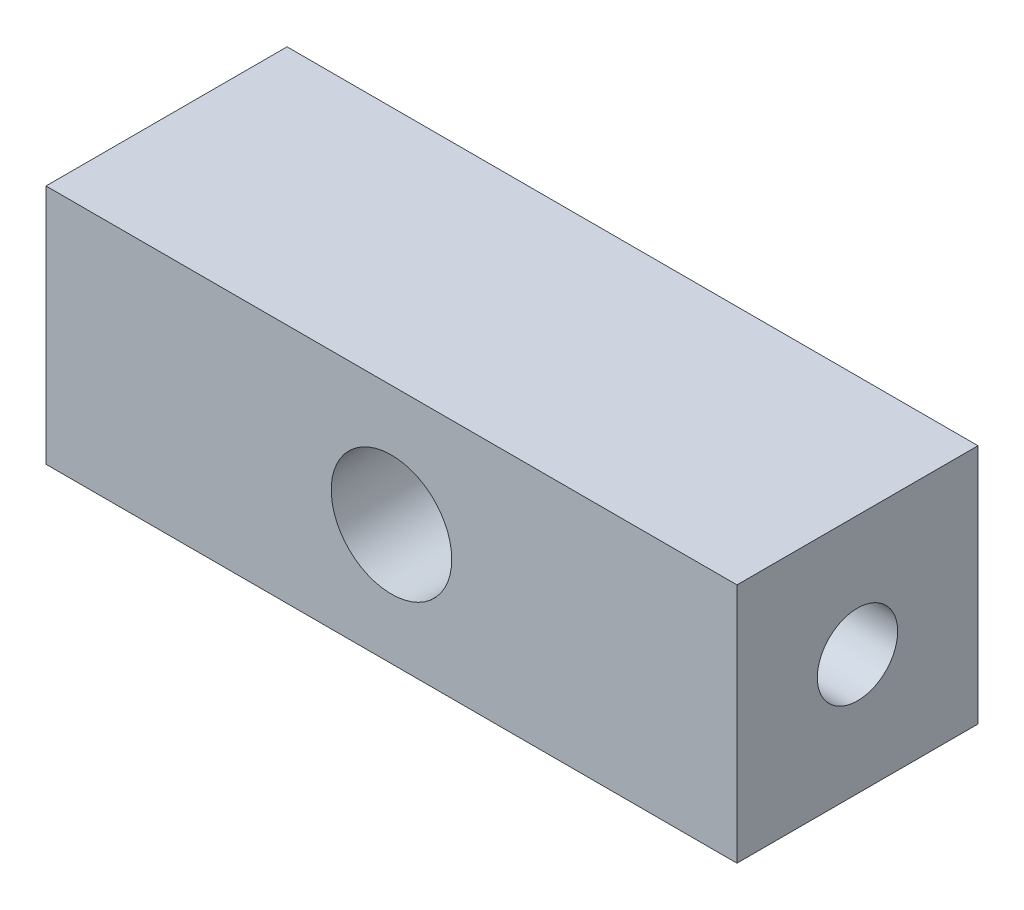
ISO-10303-21;
HEADER;
FILE_DESCRIPTION(('STEP AP214'),'2;1');
FILE_NAME('part.step','',(''),(''),'','','');
FILE_SCHEMA(('AUTOMOTIVE_DESIGN { 1 0 10303 214 1 1 1 1 }'));
ENDSEC;
DATA;
#1=APPLICATION_CONTEXT('core data for automotive mechanical design processes');
#2=APPLICATION_PROTOCOL_DEFINITION('international standard','automotive_design',2000,#1);
#3=PRODUCT_CONTEXT('',#1,'mechanical');
#4=PRODUCT('Part','Part','',(#3));
#5=PRODUCT_RELATED_PRODUCT_CATEGORY('part','',(#4));
#6=PRODUCT_DEFINITION_FORMATION('','',#4);
#7=PRODUCT_DEFINITION_CONTEXT('part definition',#1,'design');
#8=PRODUCT_DEFINITION('design','',#6,#7);
#9=PRODUCT_DEFINITION_SHAPE('','',#8);
#10=(LENGTH_UNIT() NAMED_UNIT(*) SI_UNIT(.MILLI.,.METRE.));
#11=(NAMED_UNIT(*) PLANE_ANGLE_UNIT() SI_UNIT($,.RADIAN.));
#12=(NAMED_UNIT(*) SI_UNIT($,.STERADIAN.) SOLID_ANGLE_UNIT());
#13=UNCERTAINTY_MEASURE_WITH_UNIT(LENGTH_MEASURE(1.E-05),#10,'distance_accuracy_value','');
#14=(GEOMETRIC_REPRESENTATION_CONTEXT(3) GLOBAL_UNCERTAINTY_ASSIGNED_CONTEXT((#13)) GLOBAL_UNIT_ASSIGNED_CONTEXT((#10,
#11,#12)) REPRESENTATION_CONTEXT('',''));
#15=CARTESIAN_POINT('',(0.,0.,0.));
#16=DIRECTION('',(0.,0.,1.));
#17=DIRECTION('',(1.,0.,0.));
#18=AXIS2_PLACEMENT_3D('',#15,#16,#17);
#19=CARTESIAN_POINT('',(0.,0.,15.));
#20=DIRECTION('',(0.,0.,-1.));
#21=DIRECTION('',(-1.,0.,0.));
#22=AXIS2_PLACEMENT_3D('',#19,#20,#21);
#23=PLANE('',#22);
#24=DIRECTION('',(0.,1.,0.));
#25=VECTOR('',#24,1.);
#26=CARTESIAN_POINT('',(43.,-15.,15.));
#27=LINE('',#26,#25);
#28=CARTESIAN_POINT('',(43.,-15.,15.));
#29=VERTEX_POINT('',#28);
#30=CARTESIAN_POINT('',(43.,15.,15.));
#31=VERTEX_POINT('',#30);
#32=EDGE_CURVE('E99',#29,#31,#27,.T.);
#33=ORIENTED_EDGE('',*,*,#32,.T.);
#34=DIRECTION('',(-1.,0.,0.));
#35=VECTOR('',#34,1.);
#36=CARTESIAN_POINT('',(-43.,15.,15.));
#37=LINE('',#36,#35);
#38=CARTESIAN_POINT('',(-43.,15.,15.));
#39=VERTEX_POINT('',#38);
#40=EDGE_CURVE('E94',#31,#39,#37,.T.);
#41=ORIENTED_EDGE('',*,*,#40,.T.);
#42=DIRECTION('',(0.,-1.,0.));
#43=VECTOR('',#42,1.);
#44=CARTESIAN_POINT('',(-43.,-15.,15.));
#45=LINE('',#44,#43);
#46=CARTESIAN_POINT('',(-43.,-15.,15.));
#47=VERTEX_POINT('',#46);
#48=EDGE_CURVE('E97',#39,#47,#45,.T.);
#49=ORIENTED_EDGE('',*,*,#48,.T.);
#50=DIRECTION('',(1.,0.,0.));
#51=VECTOR('',#50,1.);
#52=CARTESIAN_POINT('',(-43.,-15.,15.));
#53=LINE('',#52,#51);
#54=EDGE_CURVE('E64',#47,#29,#53,.T.);
#55=ORIENTED_EDGE('',*,*,#54,.T.);
#56=EDGE_LOOP('',(#33,#41,#49,#55));
#57=FACE_BOUND('',#56,.T.);
#58=CARTESIAN_POINT('',(0.,0.,15.));
#59=DIRECTION('',(0.,0.,1.));
#60=DIRECTION('',(1.,0.,0.));
#61=AXIS2_PLACEMENT_3D('',#58,#59,#60);
#62=CIRCLE('',#61,7.5);
#63=CARTESIAN_POINT('',(7.5,0.,15.));
#64=VERTEX_POINT('',#63);
#65=EDGE_CURVE('E120',#64,#64,#62,.T.);
#66=ORIENTED_EDGE('',*,*,#65,.F.);
#67=EDGE_LOOP('',(#66));
#68=FACE_BOUND('',#67,.T.);
#69=ADVANCED_FACE('F39',(#57,#68),#23,.F.);
#70=CARTESIAN_POINT('',(0.,0.,-15.));
#71=DIRECTION('',(0.,0.,-1.));
#72=DIRECTION('',(-1.,0.,0.));
#73=AXIS2_PLACEMENT_3D('',#70,#71,#72);
#74=PLANE('',#73);
#75=DIRECTION('',(0.,1.,0.));
#76=VECTOR('',#75,1.);
#77=CARTESIAN_POINT('',(43.,-15.,-15.));
#78=LINE('',#77,#76);
#79=CARTESIAN_POINT('',(43.,-15.,-15.));
#80=VERTEX_POINT('',#79);
#81=CARTESIAN_POINT('',(43.,15.,-15.));
#82=VERTEX_POINT('',#81);
#83=EDGE_CURVE('E116',#80,#82,#78,.T.);
#84=ORIENTED_EDGE('',*,*,#83,.F.);
#85=DIRECTION('',(1.,0.,0.));
#86=VECTOR('',#85,1.);
#87=CARTESIAN_POINT('',(-43.,-15.,-15.));
#88=LINE('',#87,#86);
#89=CARTESIAN_POINT('',(-43.,-15.,-15.));
#90=VERTEX_POINT('',#89);
#91=EDGE_CURVE('E87',#90,#80,#88,.T.);
#92=ORIENTED_EDGE('',*,*,#91,.F.);
#93=DIRECTION('',(0.,-1.,0.));
#94=VECTOR('',#93,1.);
#95=CARTESIAN_POINT('',(-43.,-15.,-15.));
#96=LINE('',#95,#94);
#97=CARTESIAN_POINT('',(-43.,15.,-15.));
#98=VERTEX_POINT('',#97);
#99=EDGE_CURVE('E81',#98,#90,#96,.T.);
#100=ORIENTED_EDGE('',*,*,#99,.F.);
#101=DIRECTION('',(-1.,0.,0.));
#102=VECTOR('',#101,1.);
#103=CARTESIAN_POINT('',(-43.,15.,-15.));
#104=LINE('',#103,#102);
#105=EDGE_CURVE('E104',#82,#98,#104,.T.);
#106=ORIENTED_EDGE('',*,*,#105,.F.);
#107=EDGE_LOOP('',(#84,#92,#100,#106));
#108=FACE_BOUND('',#107,.T.);
#109=CARTESIAN_POINT('',(0.,0.,-15.));
#110=DIRECTION('',(0.,0.,1.));
#111=DIRECTION('',(1.,0.,0.));
#112=AXIS2_PLACEMENT_3D('',#109,#110,#111);
#113=CIRCLE('',#112,7.5);
#114=CARTESIAN_POINT('',(7.5,0.,-15.));
#115=VERTEX_POINT('',#114);
#116=EDGE_CURVE('E181',#115,#115,#113,.T.);
#117=ORIENTED_EDGE('',*,*,#116,.T.);
#118=EDGE_LOOP('',(#117));
#119=FACE_BOUND('',#118,.T.);
#120=ADVANCED_FACE('F155',(#108,#119),#74,.T.);
#121=CARTESIAN_POINT('',(43.,-15.,15.));
#122=DIRECTION('',(-1.,0.,0.));
#123=DIRECTION('',(0.,0.,1.));
#124=AXIS2_PLACEMENT_3D('',#121,#122,#123);
#125=PLANE('',#124);
#126=CARTESIAN_POINT('',(43.,0.,0.));
#127=DIRECTION('',(1.,0.,0.));
#128=DIRECTION('',(0.,0.,-1.));
#129=AXIS2_PLACEMENT_3D('',#126,#127,#128);
#130=CIRCLE('',#129,5.);
#131=CARTESIAN_POINT('',(43.,0.,-5.));
#132=VERTEX_POINT('',#131);
#133=EDGE_CURVE('E176',#132,#132,#130,.T.);
#134=ORIENTED_EDGE('',*,*,#133,.F.);
#135=EDGE_LOOP('',(#134));
#136=FACE_BOUND('',#135,.T.);
#137=ORIENTED_EDGE('',*,*,#83,.T.);
#138=DIRECTION('',(0.,0.,-1.));
#139=VECTOR('',#138,1.);
#140=CARTESIAN_POINT('',(43.,15.,15.));
#141=LINE('',#140,#139);
#142=EDGE_CURVE('E11',#31,#82,#141,.T.);
#143=ORIENTED_EDGE('',*,*,#142,.F.);
#144=ORIENTED_EDGE('',*,*,#32,.F.);
#145=DIRECTION('',(0.,0.,-1.));
#146=VECTOR('',#145,1.);
#147=CARTESIAN_POINT('',(43.,-15.,15.));
#148=LINE('',#147,#146);
#149=EDGE_CURVE('E112',#29,#80,#148,.T.);
#150=ORIENTED_EDGE('',*,*,#149,.T.);
#151=EDGE_LOOP('',(#137,#143,#144,#150));
#152=FACE_BOUND('',#151,.T.);
#153=ADVANCED_FACE('F41',(#136,#152),#125,.F.);
#154=CARTESIAN_POINT('',(-43.,15.,15.));
#155=DIRECTION('',(0.,-1.,0.));
#156=DIRECTION('',(0.,0.,-1.));
#157=AXIS2_PLACEMENT_3D('',#154,#155,#156);
#158=PLANE('',#157);
#159=ORIENTED_EDGE('',*,*,#105,.T.);
#160=DIRECTION('',(0.,0.,-1.));
#161=VECTOR('',#160,1.);
#162=CARTESIAN_POINT('',(-43.,15.,15.));
#163=LINE('',#162,#161);
#164=EDGE_CURVE('E55',#39,#98,#163,.T.);
#165=ORIENTED_EDGE('',*,*,#164,.F.);
#166=ORIENTED_EDGE('',*,*,#40,.F.);
#167=ORIENTED_EDGE('',*,*,#142,.T.);
#168=EDGE_LOOP('',(#159,#165,#166,#167));
#169=FACE_BOUND('',#168,.T.);
#170=ADVANCED_FACE('F103',(#169),#158,.F.);
#171=CARTESIAN_POINT('',(-43.,-15.,15.));
#172=DIRECTION('',(1.,0.,0.));
#173=DIRECTION('',(0.,0.,-1.));
#174=AXIS2_PLACEMENT_3D('',#171,#172,#173);
#175=PLANE('',#174);
#176=CARTESIAN_POINT('',(-43.,0.,0.));
#177=DIRECTION('',(1.,0.,0.));
#178=DIRECTION('',(0.,0.,-1.));
#179=AXIS2_PLACEMENT_3D('',#176,#177,#178);
#180=CIRCLE('',#179,5.);
#181=CARTESIAN_POINT('',(-43.,0.,-5.));
#182=VERTEX_POINT('',#181);
#183=EDGE_CURVE('E136',#182,#182,#180,.T.);
#184=ORIENTED_EDGE('',*,*,#183,.T.);
#185=EDGE_LOOP('',(#184));
#186=FACE_BOUND('',#185,.T.);
#187=ORIENTED_EDGE('',*,*,#99,.T.);
#188=DIRECTION('',(0.,0.,-1.));
#189=VECTOR('',#188,1.);
#190=CARTESIAN_POINT('',(-43.,-15.,15.));
#191=LINE('',#190,#189);
#192=EDGE_CURVE('E106',#47,#90,#191,.T.);
#193=ORIENTED_EDGE('',*,*,#192,.F.);
#194=ORIENTED_EDGE('',*,*,#48,.F.);
#195=ORIENTED_EDGE('',*,*,#164,.T.);
#196=EDGE_LOOP('',(#187,#193,#194,#195));
#197=FACE_BOUND('',#196,.T.);
#198=ADVANCED_FACE('F108',(#186,#197),#175,.F.);
#199=CARTESIAN_POINT('',(-43.,-15.,15.));
#200=DIRECTION('',(0.,1.,0.));
#201=DIRECTION('',(0.,0.,1.));
#202=AXIS2_PLACEMENT_3D('',#199,#200,#201);
#203=PLANE('',#202);
#204=ORIENTED_EDGE('',*,*,#91,.T.);
#205=ORIENTED_EDGE('',*,*,#149,.F.);
#206=ORIENTED_EDGE('',*,*,#54,.F.);
#207=ORIENTED_EDGE('',*,*,#192,.T.);
#208=EDGE_LOOP('',(#204,#205,#206,#207));
#209=FACE_BOUND('',#208,.T.);
#210=ADVANCED_FACE('F151',(#209),#203,.F.);
#211=CARTESIAN_POINT('',(0.,0.,15.));
#212=DIRECTION('',(0.,0.,-1.));
#213=DIRECTION('',(-1.,0.,0.));
#214=AXIS2_PLACEMENT_3D('',#211,#212,#213);
#215=CYLINDRICAL_SURFACE('',#214,7.5);
#216=CARTESIAN_POINT('',(-7.5,0.,5.));
#217=CARTESIAN_POINT('',(-7.49999996320963,-0.125608018588548,4.99999996332958));
#218=CARTESIAN_POINT('',(-7.49683780664486,-0.251216670884861,4.99526045609656));
#219=CARTESIAN_POINT('',(-7.48426887523008,-0.501407130429646,4.97637719344278));
#220=CARTESIAN_POINT('',(-7.47486206751269,-0.625988932270019,4.96223338852455));
#221=CARTESIAN_POINT('',(-7.45003382341075,-0.873171719994341,4.92475388496588));
#222=CARTESIAN_POINT('',(-7.43461128487837,-0.99577233861483,4.90141650195336));
#223=CARTESIAN_POINT('',(-7.39811136676745,-1.23813427215697,4.84587344243482));
#224=CARTESIAN_POINT('',(-7.37703158367565,-1.35789435666897,4.8136639964275));
#225=CARTESIAN_POINT('',(-7.32981525375344,-1.59314893798378,4.74098638489601));
#226=CARTESIAN_POINT('',(-7.30370546494928,-1.70866231614512,4.70056186113887));
#227=CARTESIAN_POINT('',(-7.24690654349893,-1.93546860882204,4.61181215495731));
#228=CARTESIAN_POINT('',(-7.21621562725325,-2.04675985824915,4.56348389461676));
#229=CARTESIAN_POINT('',(-7.11817827260879,-2.37341381762447,4.40738741786011));
#230=CARTESIAN_POINT('',(-7.04482484943509,-2.58175996249981,4.28844372586616));
#231=CARTESIAN_POINT('',(-6.88067945428324,-2.99324442404475,4.01334849863612));
#232=CARTESIAN_POINT('',(-6.78893589581815,-3.19444057723902,3.85489609546823));
#233=CARTESIAN_POINT('',(-6.59954434905881,-3.56933031224002,3.51065910883303));
#234=CARTESIAN_POINT('',(-6.5018880214744,-3.74298373794807,3.32483536621252));
#235=CARTESIAN_POINT('',(-6.34919628009922,-3.99366214280298,3.01202024399453));
#236=CARTESIAN_POINT('',(-6.29351311736736,-4.08060552383283,2.89316385177453));
#237=CARTESIAN_POINT('',(-6.18443450280949,-4.24410607449973,2.6475199343164));
#238=CARTESIAN_POINT('',(-6.13103957232405,-4.32066088576891,2.52073061769334));
#239=CARTESIAN_POINT('',(-5.97715554289977,-4.53366662201286,2.12929062591451));
#240=CARTESIAN_POINT('',(-5.88264084043698,-4.65396866792279,1.85293596756271));
#241=CARTESIAN_POINT('',(-5.74940066178898,-4.81686735383668,1.3581492370559));
#242=CARTESIAN_POINT('',(-5.70244638338744,-4.87187088253824,1.1460313437967));
#243=CARTESIAN_POINT('',(-5.64915905133327,-4.93332515657475,0.821257693119102));
#244=CARTESIAN_POINT('',(-5.63425589706967,-4.95029943249,0.711934830996303));
#245=CARTESIAN_POINT('',(-5.61069296640748,-4.97699249744458,0.491757384373762));
#246=CARTESIAN_POINT('',(-5.6020309479698,-4.98671389202271,0.38090336452041));
#247=CARTESIAN_POINT('',(-5.59128886396067,-4.99875512937179,0.157992425508245));
#248=CARTESIAN_POINT('',(-5.58923742257986,-5.00104278396599,0.045932377579079));
#249=CARTESIAN_POINT('',(-5.5918825450767,-4.9980849918467,-0.17800706469552));
#250=CARTESIAN_POINT('',(-5.59657913187616,-4.99283951954458,-0.289886458426012));
#251=CARTESIAN_POINT('',(-5.61252620448123,-4.97490634187683,-0.512636091336137));
#252=CARTESIAN_POINT('',(-5.62378029227563,-4.96221454627213,-0.623505741850759));
#253=CARTESIAN_POINT('',(-5.65238050674852,-4.92961024185719,-0.843396564451179));
#254=CARTESIAN_POINT('',(-5.66972910561612,-4.90969480272766,-0.952416967563864));
#255=CARTESIAN_POINT('',(-5.72818076911837,-4.84163703367357,-1.26603456504467));
#256=CARTESIAN_POINT('',(-5.77653702126334,-4.78429713380928,-1.46736629283408));
#257=CARTESIAN_POINT('',(-5.88774075486078,-4.64674861534595,-1.85759628783405));
#258=CARTESIAN_POINT('',(-5.95059300345544,-4.56653247162609,-2.0464904385054));
#259=CARTESIAN_POINT('',(-6.09910267461486,-4.36685173998334,-2.44754530140424));
#260=CARTESIAN_POINT('',(-6.18679835791932,-4.24272264703471,-2.65662327497203));
#261=CARTESIAN_POINT('',(-6.36729804082079,-3.96670264496565,-3.05348499728716));
#262=CARTESIAN_POINT('',(-6.46010824109834,-3.81477749526626,-3.24124201432436));
#263=CARTESIAN_POINT('',(-6.60779163713999,-3.54969108213473,-3.52437255800004));
#264=CARTESIAN_POINT('',(-6.66328847782504,-3.44464766421749,-3.62713083172277));
#265=CARTESIAN_POINT('',(-6.77217054484313,-3.22531791748826,-3.82347713970009));
#266=CARTESIAN_POINT('',(-6.82555639146258,-3.11103433427816,-3.9170678798286));
#267=CARTESIAN_POINT('',(-6.92883688982357,-2.87366828778324,-4.09438233562589));
#268=CARTESIAN_POINT('',(-6.97873321853711,-2.75059010925358,-4.17811080427028));
#269=CARTESIAN_POINT('',(-7.07374288615761,-2.49611507932345,-4.33494297641303));
#270=CARTESIAN_POINT('',(-7.11885767470596,-2.36472076856899,-4.40804990259985));
#271=CARTESIAN_POINT('',(-7.1947926112122,-2.12083178608808,-4.52955003710702));
#272=CARTESIAN_POINT('',(-7.22668145195663,-2.00967972723592,-4.57997874330749));
#273=CARTESIAN_POINT('',(-7.2859316600916,-1.78295269143194,-4.67290941874381));
#274=CARTESIAN_POINT('',(-7.31329394408637,-1.66737861576613,-4.71541299299981));
#275=CARTESIAN_POINT('',(-7.36291212748662,-1.43245611415626,-4.79200645983731));
#276=CARTESIAN_POINT('',(-7.38517017742725,-1.31310930196114,-4.82609989626979));
#277=CARTESIAN_POINT('',(-7.42408961793734,-1.07138735730615,-4.88544867675417));
#278=CARTESIAN_POINT('',(-7.44075325872844,-0.949013463736592,-4.91070757446615));
#279=CARTESIAN_POINT('',(-7.4681644674329,-0.701493288803491,-4.95214332041752));
#280=CARTESIAN_POINT('',(-7.4788845658993,-0.576336870259732,-4.96827800575267));
#281=CARTESIAN_POINT('',(-7.4940239148013,-0.324780008160031,-4.9910386561188));
#282=CARTESIAN_POINT('',(-7.49844315700379,-0.198379562978779,-4.99766460872505));
#283=CARTESIAN_POINT('',(-7.50086789804063,0.0546163050195368,-5.00130194416532));
#284=CARTESIAN_POINT('',(-7.49887366122603,0.181211719585368,-4.99831372327676));
#285=CARTESIAN_POINT('',(-7.48852351947421,0.433544937832567,-4.98277210202707));
#286=CARTESIAN_POINT('',(-7.48016788605485,0.559282777885928,-4.97021910991058));
#287=CARTESIAN_POINT('',(-7.45811180800349,0.800084092730023,-4.93696015755831));
#288=CARTESIAN_POINT('',(-7.44483013834048,0.915274689503107,-4.91689203663253));
#289=CARTESIAN_POINT('',(-7.41323727394235,1.14332502618366,-4.86892255510859));
#290=CARTESIAN_POINT('',(-7.39492437584217,1.25618396274926,-4.84101854153162));
#291=CARTESIAN_POINT('',(-7.33297199401165,1.59016819827962,-4.74603269888999));
#292=CARTESIAN_POINT('',(-7.28229985688257,1.80689828647146,-4.66764915658682));
#293=CARTESIAN_POINT('',(-7.16240567052806,2.23669773147039,-4.47836285798313));
#294=CARTESIAN_POINT('',(-7.09224590701723,2.44875011842611,-4.36577789105498));
#295=CARTESIAN_POINT('',(-6.94004723718924,2.8516978970661,-4.11391849994205));
#296=CARTESIAN_POINT('',(-6.85800100215921,3.0425801069499,-3.97462759270444));
#297=CARTESIAN_POINT('',(-6.67386338599776,3.42963933761377,-3.64847975744913));
#298=CARTESIAN_POINT('',(-6.57065384591326,3.62188054324072,-3.45758419366078));
#299=CARTESIAN_POINT('',(-6.36427940129081,3.97334834714671,-3.04722158136621));
#300=CARTESIAN_POINT('',(-6.26111457639159,4.13255212685988,-2.82773495453724));
#301=CARTESIAN_POINT('',(-6.07349195966786,4.40311961015302,-2.38214392019828));
#302=CARTESIAN_POINT('',(-5.98818993185449,4.51739093945808,-2.15816986386051));
#303=CARTESIAN_POINT('',(-5.83597435045316,4.71240530724639,-1.69031842127984));
#304=CARTESIAN_POINT('',(-5.76902777392138,4.79320869285461,-1.44647781589623));
#305=CARTESIAN_POINT('',(-5.67333023681701,4.90589604497064,-0.988588649429973));
#306=CARTESIAN_POINT('',(-5.63987506376385,4.94396476310194,-0.777070027915116));
#307=CARTESIAN_POINT('',(-5.59698654785069,4.99248032394649,-0.348567243612225));
#308=CARTESIAN_POINT('',(-5.58752711368552,5.00295716862677,-0.131589276518499));
#309=CARTESIAN_POINT('',(-5.59410544900805,4.99559738764621,0.301609297155851));
#310=CARTESIAN_POINT('',(-5.61015831597501,4.97774399693959,0.517829379343263));
#311=CARTESIAN_POINT('',(-5.66525973970472,4.91492740617482,0.943352637174756));
#312=CARTESIAN_POINT('',(-5.7043389738479,4.8699280383881,1.15264619119367));
#313=CARTESIAN_POINT('',(-5.81317852459072,4.73981418276009,1.61430721309));
#314=CARTESIAN_POINT('',(-5.88833948649796,4.64720557432273,1.86329193737393));
#315=CARTESIAN_POINT('',(-6.0137282216154,4.48217153169634,2.2197721527126));
#316=CARTESIAN_POINT('',(-6.05768608443999,4.4227291606703,2.33588098122704));
#317=CARTESIAN_POINT('',(-6.14853438480218,4.29553797555823,2.5622633756569));
#318=CARTESIAN_POINT('',(-6.19542487694525,4.22778900678103,2.67253683284727));
#319=CARTESIAN_POINT('',(-6.34038233699541,4.0100125161287,2.99813157273274));
#320=CARTESIAN_POINT('',(-6.44119239434723,3.84739387541879,3.20406498890246));
#321=CARTESIAN_POINT('',(-6.5908294854328,3.58070368138863,3.49223623047968));
#322=CARTESIAN_POINT('',(-6.64046727146306,3.48796686520542,3.5848751310009));
#323=CARTESIAN_POINT('',(-6.73828470699057,3.29502624182907,3.76298200605057));
#324=CARTESIAN_POINT('',(-6.78646402214187,3.19482074044039,3.84844834415119));
#325=CARTESIAN_POINT('',(-6.88712610322217,2.97228582382091,4.02347385839299));
#326=CARTESIAN_POINT('',(-6.93922872778525,2.84884898400047,4.11184847540997));
#327=CARTESIAN_POINT('',(-7.03877400576411,2.59315796105784,4.27770219318705));
#328=CARTESIAN_POINT('',(-7.08621876519301,2.46090780863047,4.35518622493486));
#329=CARTESIAN_POINT('',(-7.17506685821063,2.18836443414478,4.49830278427693));
#330=CARTESIAN_POINT('',(-7.21647581452224,2.04807886951547,4.56394635570691));
#331=CARTESIAN_POINT('',(-7.29200187013099,1.76034275764726,4.68245428044414));
#332=CARTESIAN_POINT('',(-7.32612152964091,1.61289474847383,4.73532312146547));
#333=CARTESIAN_POINT('',(-7.37927647812224,1.34555428333911,4.81710032821547));
#334=CARTESIAN_POINT('',(-7.39997893582426,1.22681585673933,4.84872238892977));
#335=CARTESIAN_POINT('',(-7.43582405760531,0.986541218916701,4.90325435730034));
#336=CARTESIAN_POINT('',(-7.45096786434905,0.865005588166455,4.9261660555379));
#337=CARTESIAN_POINT('',(-7.47533722218222,0.620058880061075,4.96294834023699));
#338=CARTESIAN_POINT('',(-7.48456629083545,0.496648962158446,4.97682430043646));
#339=CARTESIAN_POINT('',(-7.49689781286771,0.248826261701855,4.99535032150822));
#340=CARTESIAN_POINT('',(-7.50000003644048,0.124413441706682,5.00000003632167));
#341=CARTESIAN_POINT('',(-7.5,0.,5.));
#342=B_SPLINE_CURVE_WITH_KNOTS('',3,(#216,#217,#218,#219,#220,#221,#222,#223,#224,#225,#226,
#227,#228,#229,#230,#231,#232,#233,#234,#235,#236,#237,#238,#239,#240,#241,#242,#243,#244,#245,
#246,#247,#248,#249,#250,#251,#252,#253,#254,#255,#256,#257,#258,#259,#260,#261,#262,#263,#264,
#265,#266,#267,#268,#269,#270,#271,#272,#273,#274,#275,#276,#277,#278,#279,#280,#281,#282,#283,
#284,#285,#286,#287,#288,#289,#290,#291,#292,#293,#294,#295,#296,#297,#298,#299,#300,#301,#302,
#303,#304,#305,#306,#307,#308,#309,#310,#311,#312,#313,#314,#315,#316,#317,#318,#319,#320,#321,
#322,#323,#324,#325,#326,#327,#328,#329,#330,#331,#332,#333,#334,#335,#336,#337,#338,#339,#340,
#341),.UNSPECIFIED.,.T.,.F.,(4,2,2,2,2,2,2,2,2,2,2,2,2,2,2,2,2,2,2,2,2,2,2,2,2,2,2,2,2,2,2,2,2,
2,2,2,2,2,2,2,2,2,2,2,2,2,2,2,2,2,2,2,2,2,2,2,2,2,2,2,2,2,4),(0.,0.376697150092868,
0.7533962828654,1.13016446348966,1.5070929703719,1.88206910413628,2.2571916123895,
3.00679232609858,3.82000195441008,4.63438651949459,5.10618372652056,5.57808786035318,
6.5193034140896,7.18876311985435,7.52328813363274,7.85769291407032,8.19354375486222,
8.52939573647986,8.86543237335315,9.20160547846822,9.84356710192613,10.4857401421745,
11.2585349135694,12.032288141549,12.5030398312138,12.9736521532471,13.44403673454,
13.9142782967795,14.2923626335413,14.6703703162267,15.0482184414745,15.4259144034603,
15.8053417246619,16.184769541648,16.5641817195628,16.9435777042718,17.2962009039366,
17.6489436346054,18.3538353932503,19.1014251855315,19.8494778884236,20.7158209183258,
21.5827603441875,22.3763648974055,23.1685321808116,23.8182177151969,24.4671965231208,
25.1165595219072,25.7667896111035,26.5902817323984,27.0029102138176,27.4155463806554,
28.2552096763187,28.6754157798874,29.0957174947647,29.5765774176914,30.0572189128906,
30.5374097593981,31.0174316706402,31.3908313299587,31.7641541882901,32.1372548206283,
32.5103694469936),.UNSPECIFIED.);
#343=CARTESIAN_POINT('',(-7.5,0.,5.));
#344=VERTEX_POINT('',#343);
#345=EDGE_CURVE('E43',#344,#344,#342,.T.);
#346=ORIENTED_EDGE('',*,*,#345,.F.);
#347=EDGE_LOOP('',(#346));
#348=FACE_BOUND('',#347,.T.);
#349=CARTESIAN_POINT('',(7.5,0.,-5.));
#350=CARTESIAN_POINT('',(7.49999996320963,-0.125608018588548,-4.99999996332958));
#351=CARTESIAN_POINT('',(7.49683780664486,-0.251216670884861,-4.99526045609656));
#352=CARTESIAN_POINT('',(7.48426887523008,-0.501407130429646,-4.97637719344278));
#353=CARTESIAN_POINT('',(7.47486206751269,-0.625988932270019,-4.96223338852455));
#354=CARTESIAN_POINT('',(7.45003382341075,-0.873171719994341,-4.92475388496588));
#355=CARTESIAN_POINT('',(7.43461128487837,-0.99577233861483,-4.90141650195336));
#356=CARTESIAN_POINT('',(7.39811136676745,-1.23813427215697,-4.84587344243482));
#357=CARTESIAN_POINT('',(7.37703158367565,-1.35789435666897,-4.8136639964275));
#358=CARTESIAN_POINT('',(7.32981525375344,-1.59314893798378,-4.74098638489601));
#359=CARTESIAN_POINT('',(7.30370546494928,-1.70866231614512,-4.70056186113887));
#360=CARTESIAN_POINT('',(7.24690654349893,-1.93546860882204,-4.61181215495731));
#361=CARTESIAN_POINT('',(7.21621562725325,-2.04675985824915,-4.56348389461676));
#362=CARTESIAN_POINT('',(7.11817827260879,-2.37341381762447,-4.40738741786011));
#363=CARTESIAN_POINT('',(7.04482484943509,-2.58175996249981,-4.28844372586616));
#364=CARTESIAN_POINT('',(6.88067945428324,-2.99324442404475,-4.01334849863612));
#365=CARTESIAN_POINT('',(6.78893589581815,-3.19444057723902,-3.85489609546823));
#366=CARTESIAN_POINT('',(6.59954434905881,-3.56933031224002,-3.51065910883303));
#367=CARTESIAN_POINT('',(6.5018880214744,-3.74298373794807,-3.32483536621252));
#368=CARTESIAN_POINT('',(6.34919628009922,-3.99366214280298,-3.01202024399453));
#369=CARTESIAN_POINT('',(6.29351311736736,-4.08060552383283,-2.89316385177453));
#370=CARTESIAN_POINT('',(6.18443450280949,-4.24410607449973,-2.6475199343164));
#371=CARTESIAN_POINT('',(6.13103957232405,-4.32066088576891,-2.52073061769334));
#372=CARTESIAN_POINT('',(5.97715554289977,-4.53366662201286,-2.12929062591451));
#373=CARTESIAN_POINT('',(5.88264084043698,-4.65396866792279,-1.85293596756271));
#374=CARTESIAN_POINT('',(5.74940066178898,-4.81686735383668,-1.3581492370559));
#375=CARTESIAN_POINT('',(5.70244638338744,-4.87187088253824,-1.1460313437967));
#376=CARTESIAN_POINT('',(5.64915905133327,-4.93332515657475,-0.821257693119102));
#377=CARTESIAN_POINT('',(5.63425589706967,-4.95029943249,-0.711934830996303));
#378=CARTESIAN_POINT('',(5.61069296640748,-4.97699249744458,-0.491757384373762));
#379=CARTESIAN_POINT('',(5.6020309479698,-4.98671389202271,-0.38090336452041));
#380=CARTESIAN_POINT('',(5.59128886396067,-4.99875512937179,-0.157992425508245));
#381=CARTESIAN_POINT('',(5.58923742257986,-5.00104278396599,-0.045932377579079));
#382=CARTESIAN_POINT('',(5.5918825450767,-4.9980849918467,0.17800706469552));
#383=CARTESIAN_POINT('',(5.59657913187616,-4.99283951954458,0.289886458426012));
#384=CARTESIAN_POINT('',(5.61252620448123,-4.97490634187683,0.512636091336137));
#385=CARTESIAN_POINT('',(5.62378029227563,-4.96221454627213,0.623505741850759));
#386=CARTESIAN_POINT('',(5.65238050674852,-4.92961024185719,0.843396564451179));
#387=CARTESIAN_POINT('',(5.66972910561612,-4.90969480272766,0.952416967563864));
#388=CARTESIAN_POINT('',(5.72818076911837,-4.84163703367357,1.26603456504467));
#389=CARTESIAN_POINT('',(5.77653702126334,-4.78429713380928,1.46736629283408));
#390=CARTESIAN_POINT('',(5.88774075486078,-4.64674861534595,1.85759628783405));
#391=CARTESIAN_POINT('',(5.95059300345544,-4.56653247162609,2.0464904385054));
#392=CARTESIAN_POINT('',(6.09910267461486,-4.36685173998334,2.44754530140424));
#393=CARTESIAN_POINT('',(6.18679835791932,-4.24272264703471,2.65662327497203));
#394=CARTESIAN_POINT('',(6.36729804082079,-3.96670264496565,3.05348499728716));
#395=CARTESIAN_POINT('',(6.46010824109834,-3.81477749526626,3.24124201432436));
#396=CARTESIAN_POINT('',(6.60779163713999,-3.54969108213473,3.52437255800004));
#397=CARTESIAN_POINT('',(6.66328847782504,-3.44464766421749,3.62713083172277));
#398=CARTESIAN_POINT('',(6.77217054484313,-3.22531791748826,3.82347713970009));
#399=CARTESIAN_POINT('',(6.82555639146258,-3.11103433427816,3.9170678798286));
#400=CARTESIAN_POINT('',(6.92883688982357,-2.87366828778324,4.09438233562589));
#401=CARTESIAN_POINT('',(6.97873321853711,-2.75059010925358,4.17811080427028));
#402=CARTESIAN_POINT('',(7.07374288615761,-2.49611507932345,4.33494297641303));
#403=CARTESIAN_POINT('',(7.11885767470596,-2.36472076856899,4.40804990259985));
#404=CARTESIAN_POINT('',(7.1947926112122,-2.12083178608808,4.52955003710702));
#405=CARTESIAN_POINT('',(7.22668145195663,-2.00967972723592,4.57997874330749));
#406=CARTESIAN_POINT('',(7.2859316600916,-1.78295269143194,4.67290941874381));
#407=CARTESIAN_POINT('',(7.31329394408637,-1.66737861576613,4.71541299299981));
#408=CARTESIAN_POINT('',(7.36291212748662,-1.43245611415626,4.79200645983731));
#409=CARTESIAN_POINT('',(7.38517017742725,-1.31310930196114,4.82609989626979));
#410=CARTESIAN_POINT('',(7.42408961793734,-1.07138735730615,4.88544867675417));
#411=CARTESIAN_POINT('',(7.44075325872844,-0.949013463736592,4.91070757446615));
#412=CARTESIAN_POINT('',(7.4681644674329,-0.701493288803491,4.95214332041752));
#413=CARTESIAN_POINT('',(7.4788845658993,-0.576336870259732,4.96827800575267));
#414=CARTESIAN_POINT('',(7.4940239148013,-0.324780008160031,4.9910386561188));
#415=CARTESIAN_POINT('',(7.49844315700379,-0.198379562978779,4.99766460872505));
#416=CARTESIAN_POINT('',(7.50086789804063,0.0546163050195368,5.00130194416532));
#417=CARTESIAN_POINT('',(7.49887366122603,0.181211719585368,4.99831372327676));
#418=CARTESIAN_POINT('',(7.48852351947421,0.433544937832567,4.98277210202707));
#419=CARTESIAN_POINT('',(7.48016788605485,0.559282777885928,4.97021910991058));
#420=CARTESIAN_POINT('',(7.45811180800349,0.800084092730023,4.93696015755831));
#421=CARTESIAN_POINT('',(7.44483013834048,0.915274689503107,4.91689203663253));
#422=CARTESIAN_POINT('',(7.41323727394235,1.14332502618366,4.86892255510859));
#423=CARTESIAN_POINT('',(7.39492437584217,1.25618396274926,4.84101854153162));
#424=CARTESIAN_POINT('',(7.33297199401165,1.59016819827962,4.74603269888999));
#425=CARTESIAN_POINT('',(7.28229985688257,1.80689828647146,4.66764915658682));
#426=CARTESIAN_POINT('',(7.16240567052806,2.23669773147039,4.47836285798313));
#427=CARTESIAN_POINT('',(7.09224590701723,2.44875011842611,4.36577789105498));
#428=CARTESIAN_POINT('',(6.94004723718924,2.8516978970661,4.11391849994205));
#429=CARTESIAN_POINT('',(6.85800100215921,3.0425801069499,3.97462759270444));
#430=CARTESIAN_POINT('',(6.67386338599776,3.42963933761377,3.64847975744913));
#431=CARTESIAN_POINT('',(6.57065384591326,3.62188054324072,3.45758419366078));
#432=CARTESIAN_POINT('',(6.36427940129081,3.97334834714671,3.04722158136621));
#433=CARTESIAN_POINT('',(6.26111457639159,4.13255212685988,2.82773495453724));
#434=CARTESIAN_POINT('',(6.07349195966786,4.40311961015302,2.38214392019828));
#435=CARTESIAN_POINT('',(5.98818993185449,4.51739093945808,2.15816986386051));
#436=CARTESIAN_POINT('',(5.83597435045316,4.71240530724639,1.69031842127984));
#437=CARTESIAN_POINT('',(5.76902777392138,4.79320869285461,1.44647781589623));
#438=CARTESIAN_POINT('',(5.67333023681701,4.90589604497064,0.988588649429973));
#439=CARTESIAN_POINT('',(5.63987506376385,4.94396476310194,0.777070027915116));
#440=CARTESIAN_POINT('',(5.59698654785069,4.99248032394649,0.348567243612225));
#441=CARTESIAN_POINT('',(5.58752711368552,5.00295716862677,0.131589276518499));
#442=CARTESIAN_POINT('',(5.59410544900805,4.99559738764621,-0.301609297155851));
#443=CARTESIAN_POINT('',(5.61015831597501,4.97774399693959,-0.517829379343263));
#444=CARTESIAN_POINT('',(5.66525973970472,4.91492740617482,-0.943352637174756));
#445=CARTESIAN_POINT('',(5.7043389738479,4.8699280383881,-1.15264619119367));
#446=CARTESIAN_POINT('',(5.81317852459072,4.73981418276009,-1.61430721309));
#447=CARTESIAN_POINT('',(5.88833948649796,4.64720557432273,-1.86329193737393));
#448=CARTESIAN_POINT('',(6.0137282216154,4.48217153169634,-2.2197721527126));
#449=CARTESIAN_POINT('',(6.05768608443999,4.4227291606703,-2.33588098122704));
#450=CARTESIAN_POINT('',(6.14853438480218,4.29553797555823,-2.5622633756569));
#451=CARTESIAN_POINT('',(6.19542487694525,4.22778900678103,-2.67253683284727));
#452=CARTESIAN_POINT('',(6.34038233699541,4.0100125161287,-2.99813157273274));
#453=CARTESIAN_POINT('',(6.44119239434723,3.84739387541879,-3.20406498890246));
#454=CARTESIAN_POINT('',(6.5908294854328,3.58070368138863,-3.49223623047968));
#455=CARTESIAN_POINT('',(6.64046727146306,3.48796686520542,-3.5848751310009));
#456=CARTESIAN_POINT('',(6.73828470699057,3.29502624182907,-3.76298200605057));
#457=CARTESIAN_POINT('',(6.78646402214187,3.19482074044039,-3.84844834415119));
#458=CARTESIAN_POINT('',(6.88712610322217,2.97228582382091,-4.02347385839299));
#459=CARTESIAN_POINT('',(6.93922872778525,2.84884898400047,-4.11184847540997));
#460=CARTESIAN_POINT('',(7.03877400576411,2.59315796105784,-4.27770219318705));
#461=CARTESIAN_POINT('',(7.08621876519301,2.46090780863047,-4.35518622493486));
#462=CARTESIAN_POINT('',(7.17506685821063,2.18836443414478,-4.49830278427693));
#463=CARTESIAN_POINT('',(7.21647581452224,2.04807886951547,-4.56394635570691));
#464=CARTESIAN_POINT('',(7.29200187013099,1.76034275764726,-4.68245428044414));
#465=CARTESIAN_POINT('',(7.32612152964091,1.61289474847383,-4.73532312146547));
#466=CARTESIAN_POINT('',(7.37927647812224,1.34555428333911,-4.81710032821547));
#467=CARTESIAN_POINT('',(7.39997893582426,1.22681585673933,-4.84872238892977));
#468=CARTESIAN_POINT('',(7.43582405760531,0.986541218916701,-4.90325435730034));
#469=CARTESIAN_POINT('',(7.45096786434905,0.865005588166455,-4.9261660555379));
#470=CARTESIAN_POINT('',(7.47533722218222,0.620058880061075,-4.96294834023699));
#471=CARTESIAN_POINT('',(7.48456629083545,0.496648962158446,-4.97682430043646));
#472=CARTESIAN_POINT('',(7.49689781286771,0.248826261701855,-4.99535032150822));
#473=CARTESIAN_POINT('',(7.50000003644048,0.124413441706682,-5.00000003632167));
#474=CARTESIAN_POINT('',(7.5,0.,-5.));
#475=B_SPLINE_CURVE_WITH_KNOTS('',3,(#349,#350,#351,#352,#353,#354,#355,#356,#357,#358,#359,
#360,#361,#362,#363,#364,#365,#366,#367,#368,#369,#370,#371,#372,#373,#374,#375,#376,#377,#378,
#379,#380,#381,#382,#383,#384,#385,#386,#387,#388,#389,#390,#391,#392,#393,#394,#395,#396,#397,
#398,#399,#400,#401,#402,#403,#404,#405,#406,#407,#408,#409,#410,#411,#412,#413,#414,#415,#416,
#417,#418,#419,#420,#421,#422,#423,#424,#425,#426,#427,#428,#429,#430,#431,#432,#433,#434,#435,
#436,#437,#438,#439,#440,#441,#442,#443,#444,#445,#446,#447,#448,#449,#450,#451,#452,#453,#454,
#455,#456,#457,#458,#459,#460,#461,#462,#463,#464,#465,#466,#467,#468,#469,#470,#471,#472,#473,
#474),.UNSPECIFIED.,.T.,.F.,(4,2,2,2,2,2,2,2,2,2,2,2,2,2,2,2,2,2,2,2,2,2,2,2,2,2,2,2,2,2,2,2,2,
2,2,2,2,2,2,2,2,2,2,2,2,2,2,2,2,2,2,2,2,2,2,2,2,2,2,2,2,2,4),(0.,0.376697150092868,
0.7533962828654,1.13016446348966,1.5070929703719,1.88206910413628,2.2571916123895,
3.00679232609858,3.82000195441008,4.63438651949459,5.10618372652056,5.57808786035318,
6.5193034140896,7.18876311985435,7.52328813363274,7.85769291407032,8.19354375486222,
8.52939573647986,8.86543237335315,9.20160547846822,9.84356710192613,10.4857401421745,
11.2585349135694,12.032288141549,12.5030398312138,12.9736521532471,13.44403673454,
13.9142782967795,14.2923626335413,14.6703703162267,15.0482184414745,15.4259144034603,
15.8053417246619,16.184769541648,16.5641817195628,16.9435777042718,17.2962009039366,
17.6489436346054,18.3538353932503,19.1014251855315,19.8494778884236,20.7158209183258,
21.5827603441875,22.3763648974055,23.1685321808116,23.8182177151969,24.4671965231208,
25.1165595219072,25.7667896111035,26.5902817323984,27.0029102138176,27.4155463806554,
28.2552096763187,28.6754157798874,29.0957174947647,29.5765774176914,30.0572189128906,
30.5374097593981,31.0174316706402,31.3908313299587,31.7641541882901,32.1372548206283,
32.5103694469936),.UNSPECIFIED.);
#476=CARTESIAN_POINT('',(7.5,0.,-5.));
#477=VERTEX_POINT('',#476);
#478=EDGE_CURVE('E130',#477,#477,#475,.T.);
#479=ORIENTED_EDGE('',*,*,#478,.F.);
#480=EDGE_LOOP('',(#479));
#481=FACE_BOUND('',#480,.T.);
#482=ORIENTED_EDGE('',*,*,#65,.T.);
#483=EDGE_LOOP('',(#482));
#484=FACE_BOUND('',#483,.T.);
#485=ORIENTED_EDGE('',*,*,#116,.F.);
#486=EDGE_LOOP('',(#485));
#487=FACE_BOUND('',#486,.T.);
#488=ADVANCED_FACE('F137',(#348,#481,#484,#487),#215,.F.);
#489=CARTESIAN_POINT('',(-43.,0.,0.));
#490=DIRECTION('',(1.,0.,0.));
#491=DIRECTION('',(0.,0.,-1.));
#492=AXIS2_PLACEMENT_3D('',#489,#490,#491);
#493=CYLINDRICAL_SURFACE('',#492,5.);
#494=ORIENTED_EDGE('',*,*,#478,.T.);
#495=EDGE_LOOP('',(#494));
#496=FACE_BOUND('',#495,.T.);
#497=ORIENTED_EDGE('',*,*,#133,.T.);
#498=EDGE_LOOP('',(#497));
#499=FACE_BOUND('',#498,.T.);
#500=ADVANCED_FACE('F140',(#496,#499),#493,.F.);
#501=ORIENTED_EDGE('',*,*,#345,.T.);
#502=EDGE_LOOP('',(#501));
#503=FACE_BOUND('',#502,.T.);
#504=ORIENTED_EDGE('',*,*,#183,.F.);
#505=EDGE_LOOP('',(#504));
#506=FACE_BOUND('',#505,.T.);
#507=ADVANCED_FACE('F143',(#503,#506),#493,.F.);
#508=CLOSED_SHELL('',(#69,#120,#153,#170,#198,#210,#488,#500,#507));
#509=MANIFOLD_SOLID_BREP('B2',#508);
#510=ADVANCED_BREP_SHAPE_REPRESENTATION('',(#18,#509),#14);
#511=SHAPE_DEFINITION_REPRESENTATION(#9,#510);
ENDSEC;
END-ISO-10303-21;
